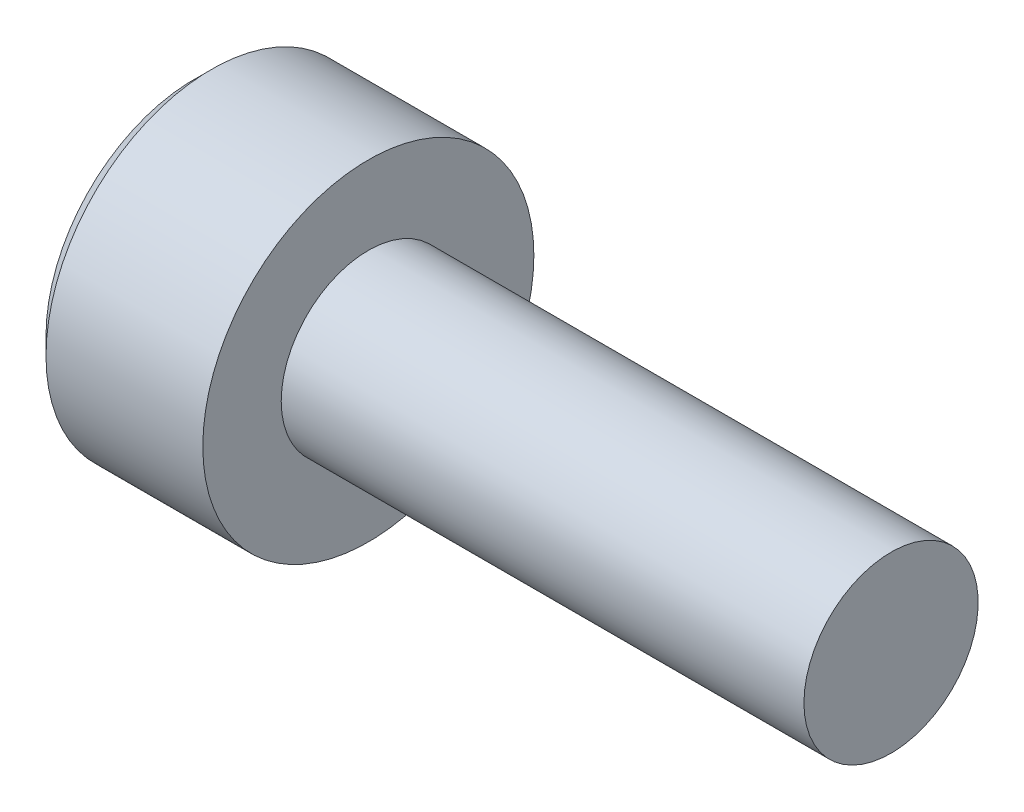
ISO-10303-21;
HEADER;
FILE_DESCRIPTION(('STEP AP214'),'2;1');
FILE_NAME('part.step','',(''),(''),'','','');
FILE_SCHEMA(('AUTOMOTIVE_DESIGN { 1 0 10303 214 1 1 1 1 }'));
ENDSEC;
DATA;
#1=APPLICATION_CONTEXT('core data for automotive mechanical design processes');
#2=APPLICATION_PROTOCOL_DEFINITION('international standard','automotive_design',2000,#1);
#3=PRODUCT_CONTEXT('',#1,'mechanical');
#4=PRODUCT('Part','Part','',(#3));
#5=PRODUCT_RELATED_PRODUCT_CATEGORY('part','',(#4));
#6=PRODUCT_DEFINITION_FORMATION('','',#4);
#7=PRODUCT_DEFINITION_CONTEXT('part definition',#1,'design');
#8=PRODUCT_DEFINITION('design','',#6,#7);
#9=PRODUCT_DEFINITION_SHAPE('','',#8);
#10=(LENGTH_UNIT() NAMED_UNIT(*) SI_UNIT(.MILLI.,.METRE.));
#11=(NAMED_UNIT(*) PLANE_ANGLE_UNIT() SI_UNIT($,.RADIAN.));
#12=(NAMED_UNIT(*) SI_UNIT($,.STERADIAN.) SOLID_ANGLE_UNIT());
#13=UNCERTAINTY_MEASURE_WITH_UNIT(LENGTH_MEASURE(1.E-05),#10,'distance_accuracy_value','');
#14=(GEOMETRIC_REPRESENTATION_CONTEXT(3) GLOBAL_UNCERTAINTY_ASSIGNED_CONTEXT((#13)) GLOBAL_UNIT_ASSIGNED_CONTEXT((#10,
#11,#12)) REPRESENTATION_CONTEXT('',''));
#15=CARTESIAN_POINT('',(0.,0.,0.));
#16=DIRECTION('',(0.,0.,1.));
#17=DIRECTION('',(1.,0.,0.));
#18=AXIS2_PLACEMENT_3D('',#15,#16,#17);
#19=CARTESIAN_POINT('',(-0.999999999976353,0.,0.));
#20=DIRECTION('',(-1.,0.,0.));
#21=DIRECTION('',(0.,0.,1.));
#22=AXIS2_PLACEMENT_3D('',#19,#20,#21);
#23=CONICAL_SURFACE('',#22,0.749999999868578,1.30899693854199);
#24=CARTESIAN_POINT('',(-0.79903810542703,0.,-5.40012479177676E-10));
#25=VERTEX_POINT('',#24);
#26=VERTEX_LOOP('',#25);
#27=FACE_BOUND('',#26,.T.);
#28=CARTESIAN_POINT('',(-1.00000000000682,0.,0.));
#29=DIRECTION('',(-1.,0.,0.));
#30=DIRECTION('',(0.,0.,1.));
#31=AXIS2_PLACEMENT_3D('',#28,#29,#30);
#32=CIRCLE('',#31,0.749999999982265);
#33=CARTESIAN_POINT('',(-1.00000000000892,0.64951905283065,-0.374999999995567));
#34=VERTEX_POINT('',#33);
#35=CARTESIAN_POINT('',(-1.00000000000952,0.,-0.749999999991132));
#36=VERTEX_POINT('',#35);
#37=EDGE_CURVE('E138',#34,#36,#32,.T.);
#38=ORIENTED_EDGE('',*,*,#37,.T.);
#39=CARTESIAN_POINT('',(-1.00000000000682,0.,0.));
#40=DIRECTION('',(-1.,0.,0.));
#41=DIRECTION('',(0.,0.,1.));
#42=AXIS2_PLACEMENT_3D('',#39,#40,#41);
#43=CIRCLE('',#42,0.749999999982265);
#44=CARTESIAN_POINT('',(-1.00000000000892,-0.649519052830649,-0.374999999995567));
#45=VERTEX_POINT('',#44);
#46=EDGE_CURVE('E136',#36,#45,#43,.T.);
#47=ORIENTED_EDGE('',*,*,#46,.T.);
#48=CARTESIAN_POINT('',(-1.00000000000682,0.,0.));
#49=DIRECTION('',(-1.,0.,0.));
#50=DIRECTION('',(0.,0.,1.));
#51=AXIS2_PLACEMENT_3D('',#48,#49,#50);
#52=CIRCLE('',#51,0.749999999982265);
#53=CARTESIAN_POINT('',(-1.00000000000892,-0.64951905283065,0.374999999995567));
#54=VERTEX_POINT('',#53);
#55=EDGE_CURVE('E88',#45,#54,#52,.T.);
#56=ORIENTED_EDGE('',*,*,#55,.T.);
#57=CARTESIAN_POINT('',(-1.00000000000682,0.,0.));
#58=DIRECTION('',(-1.,0.,0.));
#59=DIRECTION('',(0.,0.,1.));
#60=AXIS2_PLACEMENT_3D('',#57,#58,#59);
#61=CIRCLE('',#60,0.749999999982265);
#62=CARTESIAN_POINT('',(-1.00000000000952,0.,0.749999999991132));
#63=VERTEX_POINT('',#62);
#64=EDGE_CURVE('E19',#54,#63,#61,.T.);
#65=ORIENTED_EDGE('',*,*,#64,.T.);
#66=CARTESIAN_POINT('',(-1.00000000000682,0.,0.));
#67=DIRECTION('',(-1.,0.,0.));
#68=DIRECTION('',(0.,0.,1.));
#69=AXIS2_PLACEMENT_3D('',#66,#67,#68);
#70=CIRCLE('',#69,0.749999999982265);
#71=CARTESIAN_POINT('',(-1.00000000000892,0.64951905283065,0.374999999995567));
#72=VERTEX_POINT('',#71);
#73=EDGE_CURVE('E93',#63,#72,#70,.T.);
#74=ORIENTED_EDGE('',*,*,#73,.T.);
#75=CARTESIAN_POINT('',(-1.00000000000682,0.,0.));
#76=DIRECTION('',(-1.,0.,0.));
#77=DIRECTION('',(0.,0.,1.));
#78=AXIS2_PLACEMENT_3D('',#75,#76,#77);
#79=CIRCLE('',#78,0.749999999982265);
#80=EDGE_CURVE('E114',#72,#34,#79,.T.);
#81=ORIENTED_EDGE('',*,*,#80,.T.);
#82=EDGE_LOOP('',(#38,#47,#56,#65,#74,#81));
#83=FACE_BOUND('',#82,.T.);
#84=ADVANCED_FACE('F16',(#27,#83),#23,.F.);
#85=CARTESIAN_POINT('',(-1.,0.,0.));
#86=DIRECTION('',(1.,0.,0.));
#87=DIRECTION('',(0.,0.,-1.));
#88=AXIS2_PLACEMENT_3D('',#85,#86,#87);
#89=PLANE('',#88);
#90=DIRECTION('',(0.,1.,0.));
#91=VECTOR('',#90,1.);
#92=CARTESIAN_POINT('',(-1.00000000001222,0.43301270189222,0.75));
#93=LINE('',#92,#91);
#94=CARTESIAN_POINT('',(-1.00000000000611,-0.433012701895382,0.749999999994524));
#95=VERTEX_POINT('',#94);
#96=EDGE_CURVE('E98',#63,#95,#93,.F.);
#97=ORIENTED_EDGE('',*,*,#96,.F.);
#98=ORIENTED_EDGE('',*,*,#64,.F.);
#99=DIRECTION('',(0.,0.500000000000001,0.866025403784438));
#100=VECTOR('',#99,1.);
#101=CARTESIAN_POINT('',(-1.,-0.43301270189222,0.75));
#102=LINE('',#101,#100);
#103=EDGE_CURVE('E100',#95,#54,#102,.F.);
#104=ORIENTED_EDGE('',*,*,#103,.F.);
#105=EDGE_LOOP('',(#97,#98,#104));
#106=FACE_BOUND('',#105,.T.);
#107=ADVANCED_FACE('F99',(#106),#89,.F.);
#108=CARTESIAN_POINT('',(-1.,0.,0.));
#109=DIRECTION('',(1.,0.,0.));
#110=DIRECTION('',(0.,0.,-1.));
#111=AXIS2_PLACEMENT_3D('',#108,#109,#110);
#112=PLANE('',#111);
#113=DIRECTION('',(0.,0.500000000000001,-0.866025403784438));
#114=VECTOR('',#113,1.);
#115=CARTESIAN_POINT('',(-1.00000000001102,0.86602540378444,0.));
#116=LINE('',#115,#114);
#117=CARTESIAN_POINT('',(-1.00000000000551,0.43301270189222,0.75));
#118=VERTEX_POINT('',#117);
#119=EDGE_CURVE('E112',#72,#118,#116,.F.);
#120=ORIENTED_EDGE('',*,*,#119,.F.);
#121=ORIENTED_EDGE('',*,*,#73,.F.);
#122=DIRECTION('',(0.,1.,0.));
#123=VECTOR('',#122,1.);
#124=CARTESIAN_POINT('',(-1.,0.43301270189222,0.75));
#125=LINE('',#124,#123);
#126=EDGE_CURVE('E109',#118,#63,#125,.F.);
#127=ORIENTED_EDGE('',*,*,#126,.F.);
#128=EDGE_LOOP('',(#120,#121,#127));
#129=FACE_BOUND('',#128,.T.);
#130=ADVANCED_FACE('F108',(#129),#112,.F.);
#131=CARTESIAN_POINT('',(-1.,0.,0.));
#132=DIRECTION('',(1.,0.,0.));
#133=DIRECTION('',(0.,0.,-1.));
#134=AXIS2_PLACEMENT_3D('',#131,#132,#133);
#135=PLANE('',#134);
#136=DIRECTION('',(0.,0.500000000000001,-0.866025403784438));
#137=VECTOR('',#136,1.);
#138=CARTESIAN_POINT('',(-1.,0.86602540378444,0.));
#139=LINE('',#138,#137);
#140=CARTESIAN_POINT('',(-1.00000000000551,0.86602540378444,0.));
#141=VERTEX_POINT('',#140);
#142=EDGE_CURVE('E148',#141,#72,#139,.F.);
#143=ORIENTED_EDGE('',*,*,#142,.F.);
#144=DIRECTION('',(0.,-0.500000000000001,-0.866025403784438));
#145=VECTOR('',#144,1.);
#146=CARTESIAN_POINT('',(-1.00000000001102,0.43301270189222,-0.75));
#147=LINE('',#146,#145);
#148=EDGE_CURVE('E146',#34,#141,#147,.F.);
#149=ORIENTED_EDGE('',*,*,#148,.F.);
#150=ORIENTED_EDGE('',*,*,#80,.F.);
#151=EDGE_LOOP('',(#143,#149,#150));
#152=FACE_BOUND('',#151,.T.);
#153=ADVANCED_FACE('F147',(#152),#135,.F.);
#154=CARTESIAN_POINT('',(-1.,0.,0.));
#155=DIRECTION('',(1.,0.,0.));
#156=DIRECTION('',(0.,0.,-1.));
#157=AXIS2_PLACEMENT_3D('',#154,#155,#156);
#158=PLANE('',#157);
#159=DIRECTION('',(0.,1.,0.));
#160=VECTOR('',#159,1.);
#161=CARTESIAN_POINT('',(-1.00000000001222,-0.43301270189222,-0.75));
#162=LINE('',#161,#160);
#163=CARTESIAN_POINT('',(-1.00000000000611,0.433012701895382,-0.749999999994524));
#164=VERTEX_POINT('',#163);
#165=EDGE_CURVE('E160',#36,#164,#162,.T.);
#166=ORIENTED_EDGE('',*,*,#165,.F.);
#167=ORIENTED_EDGE('',*,*,#37,.F.);
#168=DIRECTION('',(0.,-0.500000000000001,-0.866025403784438));
#169=VECTOR('',#168,1.);
#170=CARTESIAN_POINT('',(-1.,0.43301270189222,-0.75));
#171=LINE('',#170,#169);
#172=EDGE_CURVE('E157',#164,#34,#171,.F.);
#173=ORIENTED_EDGE('',*,*,#172,.F.);
#174=EDGE_LOOP('',(#166,#167,#173));
#175=FACE_BOUND('',#174,.T.);
#176=ADVANCED_FACE('F156',(#175),#158,.F.);
#177=CARTESIAN_POINT('',(-1.,0.,0.));
#178=DIRECTION('',(1.,0.,0.));
#179=DIRECTION('',(0.,0.,-1.));
#180=AXIS2_PLACEMENT_3D('',#177,#178,#179);
#181=PLANE('',#180);
#182=DIRECTION('',(0.,-0.500000000000001,0.866025403784438));
#183=VECTOR('',#182,1.);
#184=CARTESIAN_POINT('',(-1.00000000001102,-0.86602540378444,0.));
#185=LINE('',#184,#183);
#186=CARTESIAN_POINT('',(-1.00000000000551,-0.43301270189222,-0.75));
#187=VERTEX_POINT('',#186);
#188=EDGE_CURVE('E186',#45,#187,#185,.F.);
#189=ORIENTED_EDGE('',*,*,#188,.F.);
#190=ORIENTED_EDGE('',*,*,#46,.F.);
#191=DIRECTION('',(0.,1.,0.));
#192=VECTOR('',#191,1.);
#193=CARTESIAN_POINT('',(-1.,-0.43301270189222,-0.75));
#194=LINE('',#193,#192);
#195=EDGE_CURVE('E190',#187,#36,#194,.T.);
#196=ORIENTED_EDGE('',*,*,#195,.F.);
#197=EDGE_LOOP('',(#189,#190,#196));
#198=FACE_BOUND('',#197,.T.);
#199=ADVANCED_FACE('F311',(#198),#181,.F.);
#200=CARTESIAN_POINT('',(-1.,0.,0.));
#201=DIRECTION('',(1.,0.,0.));
#202=DIRECTION('',(0.,0.,-1.));
#203=AXIS2_PLACEMENT_3D('',#200,#201,#202);
#204=PLANE('',#203);
#205=DIRECTION('',(0.,0.500000000000001,0.866025403784438));
#206=VECTOR('',#205,1.);
#207=CARTESIAN_POINT('',(-1.00000000001102,-0.43301270189222,0.75));
#208=LINE('',#207,#206);
#209=CARTESIAN_POINT('',(-1.00000000000367,-0.86602540378444,0.));
#210=VERTEX_POINT('',#209);
#211=EDGE_CURVE('E123',#54,#210,#208,.F.);
#212=ORIENTED_EDGE('',*,*,#211,.F.);
#213=ORIENTED_EDGE('',*,*,#55,.F.);
#214=DIRECTION('',(0.,-0.500000000000001,0.866025403784438));
#215=VECTOR('',#214,1.);
#216=CARTESIAN_POINT('',(-1.,-0.86602540378444,0.));
#217=LINE('',#216,#215);
#218=EDGE_CURVE('E191',#210,#45,#217,.F.);
#219=ORIENTED_EDGE('',*,*,#218,.F.);
#220=EDGE_LOOP('',(#212,#213,#219));
#221=FACE_BOUND('',#220,.T.);
#222=ADVANCED_FACE('F319',(#221),#204,.F.);
#223=CARTESIAN_POINT('',(-1.,-0.43301270189222,0.75));
#224=DIRECTION('',(0.,0.866025403784438,-0.500000000000001));
#225=DIRECTION('',(0.,0.500000000000001,0.866025403784438));
#226=AXIS2_PLACEMENT_3D('',#223,#224,#225);
#227=PLANE('',#226);
#228=DIRECTION('',(-1.,0.,0.));
#229=VECTOR('',#228,1.);
#230=CARTESIAN_POINT('',(-1.,-0.43301270189222,0.75));
#231=LINE('',#230,#229);
#232=CARTESIAN_POINT('',(-2.,-0.43301270189222,0.75));
#233=VERTEX_POINT('',#232);
#234=EDGE_CURVE('E105',#95,#233,#231,.T.);
#235=ORIENTED_EDGE('',*,*,#234,.F.);
#236=ORIENTED_EDGE('',*,*,#103,.T.);
#237=ORIENTED_EDGE('',*,*,#211,.T.);
#238=DIRECTION('',(1.,0.,0.));
#239=VECTOR('',#238,1.);
#240=CARTESIAN_POINT('',(-1.,-0.86602540378444,0.));
#241=LINE('',#240,#239);
#242=CARTESIAN_POINT('',(-2.,-0.86602540378444,0.));
#243=VERTEX_POINT('',#242);
#244=EDGE_CURVE('E194',#243,#210,#241,.T.);
#245=ORIENTED_EDGE('',*,*,#244,.F.);
#246=DIRECTION('',(0.,0.500000000000001,0.866025403784438));
#247=VECTOR('',#246,1.);
#248=CARTESIAN_POINT('',(-2.,-0.86602540378444,0.));
#249=LINE('',#248,#247);
#250=EDGE_CURVE('E182',#243,#233,#249,.T.);
#251=ORIENTED_EDGE('',*,*,#250,.T.);
#252=EDGE_LOOP('',(#235,#236,#237,#245,#251));
#253=FACE_BOUND('',#252,.T.);
#254=ADVANCED_FACE('F328',(#253),#227,.T.);
#255=CARTESIAN_POINT('',(-1.,0.43301270189222,0.75));
#256=DIRECTION('',(0.,0.,-1.));
#257=DIRECTION('',(-1.,0.,0.));
#258=AXIS2_PLACEMENT_3D('',#255,#256,#257);
#259=PLANE('',#258);
#260=DIRECTION('',(1.,0.,0.));
#261=VECTOR('',#260,1.);
#262=CARTESIAN_POINT('',(-1.,0.43301270189222,0.75));
#263=LINE('',#262,#261);
#264=CARTESIAN_POINT('',(-2.,0.43301270189222,0.75));
#265=VERTEX_POINT('',#264);
#266=EDGE_CURVE('E117',#118,#265,#263,.F.);
#267=ORIENTED_EDGE('',*,*,#266,.F.);
#268=ORIENTED_EDGE('',*,*,#126,.T.);
#269=ORIENTED_EDGE('',*,*,#96,.T.);
#270=ORIENTED_EDGE('',*,*,#234,.T.);
#271=DIRECTION('',(0.,1.,0.));
#272=VECTOR('',#271,1.);
#273=CARTESIAN_POINT('',(-2.,0.,0.75));
#274=LINE('',#273,#272);
#275=EDGE_CURVE('E178',#233,#265,#274,.T.);
#276=ORIENTED_EDGE('',*,*,#275,.T.);
#277=EDGE_LOOP('',(#267,#268,#269,#270,#276));
#278=FACE_BOUND('',#277,.T.);
#279=ADVANCED_FACE('F115',(#278),#259,.T.);
#280=CARTESIAN_POINT('',(-1.,0.86602540378444,0.));
#281=DIRECTION('',(0.,-0.866025403784438,-0.500000000000001));
#282=DIRECTION('',(0.,0.500000000000001,-0.866025403784438));
#283=AXIS2_PLACEMENT_3D('',#280,#281,#282);
#284=PLANE('',#283);
#285=DIRECTION('',(1.,0.,0.));
#286=VECTOR('',#285,1.);
#287=CARTESIAN_POINT('',(-1.,0.86602540378444,0.));
#288=LINE('',#287,#286);
#289=CARTESIAN_POINT('',(-2.,0.86602540378444,0.));
#290=VERTEX_POINT('',#289);
#291=EDGE_CURVE('E153',#141,#290,#288,.F.);
#292=ORIENTED_EDGE('',*,*,#291,.F.);
#293=ORIENTED_EDGE('',*,*,#142,.T.);
#294=ORIENTED_EDGE('',*,*,#119,.T.);
#295=ORIENTED_EDGE('',*,*,#266,.T.);
#296=DIRECTION('',(0.,0.500000000000001,-0.866025403784438));
#297=VECTOR('',#296,1.);
#298=CARTESIAN_POINT('',(-2.,0.43301270189222,0.75));
#299=LINE('',#298,#297);
#300=EDGE_CURVE('E172',#265,#290,#299,.T.);
#301=ORIENTED_EDGE('',*,*,#300,.T.);
#302=EDGE_LOOP('',(#292,#293,#294,#295,#301));
#303=FACE_BOUND('',#302,.T.);
#304=ADVANCED_FACE('F171',(#303),#284,.T.);
#305=CARTESIAN_POINT('',(-1.,0.43301270189222,-0.75));
#306=DIRECTION('',(0.,-0.866025403784438,0.500000000000001));
#307=DIRECTION('',(0.,-0.500000000000001,-0.866025403784438));
#308=AXIS2_PLACEMENT_3D('',#305,#306,#307);
#309=PLANE('',#308);
#310=DIRECTION('',(1.,0.,0.));
#311=VECTOR('',#310,1.);
#312=CARTESIAN_POINT('',(-1.,0.43301270189222,-0.75));
#313=LINE('',#312,#311);
#314=CARTESIAN_POINT('',(-2.,0.43301270189222,-0.75));
#315=VERTEX_POINT('',#314);
#316=EDGE_CURVE('E163',#164,#315,#313,.F.);
#317=ORIENTED_EDGE('',*,*,#316,.F.);
#318=ORIENTED_EDGE('',*,*,#172,.T.);
#319=ORIENTED_EDGE('',*,*,#148,.T.);
#320=ORIENTED_EDGE('',*,*,#291,.T.);
#321=DIRECTION('',(0.,-0.500000000000001,-0.866025403784438));
#322=VECTOR('',#321,1.);
#323=CARTESIAN_POINT('',(-2.,0.86602540378444,0.));
#324=LINE('',#323,#322);
#325=EDGE_CURVE('E179',#290,#315,#324,.T.);
#326=ORIENTED_EDGE('',*,*,#325,.T.);
#327=EDGE_LOOP('',(#317,#318,#319,#320,#326));
#328=FACE_BOUND('',#327,.T.);
#329=ADVANCED_FACE('F162',(#328),#309,.T.);
#330=CARTESIAN_POINT('',(-1.,-0.43301270189222,-0.75));
#331=DIRECTION('',(0.,0.,1.));
#332=DIRECTION('',(1.,0.,0.));
#333=AXIS2_PLACEMENT_3D('',#330,#331,#332);
#334=PLANE('',#333);
#335=DIRECTION('',(1.,0.,0.));
#336=VECTOR('',#335,1.);
#337=CARTESIAN_POINT('',(-1.,-0.43301270189222,-0.75));
#338=LINE('',#337,#336);
#339=CARTESIAN_POINT('',(-2.,-0.43301270189222,-0.75));
#340=VERTEX_POINT('',#339);
#341=EDGE_CURVE('E189',#187,#340,#338,.F.);
#342=ORIENTED_EDGE('',*,*,#341,.F.);
#343=ORIENTED_EDGE('',*,*,#195,.T.);
#344=ORIENTED_EDGE('',*,*,#165,.T.);
#345=ORIENTED_EDGE('',*,*,#316,.T.);
#346=DIRECTION('',(0.,1.,0.));
#347=VECTOR('',#346,1.);
#348=CARTESIAN_POINT('',(-2.,0.,-0.75));
#349=LINE('',#348,#347);
#350=EDGE_CURVE('E34',#315,#340,#349,.F.);
#351=ORIENTED_EDGE('',*,*,#350,.T.);
#352=EDGE_LOOP('',(#342,#343,#344,#345,#351));
#353=FACE_BOUND('',#352,.T.);
#354=ADVANCED_FACE('F203',(#353),#334,.T.);
#355=CARTESIAN_POINT('',(-1.,-0.86602540378444,0.));
#356=DIRECTION('',(0.,0.866025403784438,0.500000000000001));
#357=DIRECTION('',(0.,-0.500000000000001,0.866025403784438));
#358=AXIS2_PLACEMENT_3D('',#355,#356,#357);
#359=PLANE('',#358);
#360=ORIENTED_EDGE('',*,*,#244,.T.);
#361=ORIENTED_EDGE('',*,*,#218,.T.);
#362=ORIENTED_EDGE('',*,*,#188,.T.);
#363=ORIENTED_EDGE('',*,*,#341,.T.);
#364=DIRECTION('',(0.,-0.500000000000001,0.866025403784438));
#365=VECTOR('',#364,1.);
#366=CARTESIAN_POINT('',(-2.,-0.43301270189222,-0.75));
#367=LINE('',#366,#365);
#368=EDGE_CURVE('E134',#340,#243,#367,.T.);
#369=ORIENTED_EDGE('',*,*,#368,.T.);
#370=EDGE_LOOP('',(#360,#361,#362,#363,#369));
#371=FACE_BOUND('',#370,.T.);
#372=ADVANCED_FACE('F224',(#371),#359,.T.);
#373=CARTESIAN_POINT('',(-2.,0.,0.));
#374=DIRECTION('',(1.,0.,0.));
#375=DIRECTION('',(0.,0.,-1.));
#376=AXIS2_PLACEMENT_3D('',#373,#374,#375);
#377=PLANE('',#376);
#378=CARTESIAN_POINT('',(-1.99999999995271,0.,0.));
#379=DIRECTION('',(1.,0.,0.));
#380=DIRECTION('',(0.,0.,-1.));
#381=AXIS2_PLACEMENT_3D('',#378,#379,#380);
#382=CIRCLE('',#381,1.70000000008486);
#383=CARTESIAN_POINT('',(-1.99999999995271,0.,-1.70000000008486));
#384=VERTEX_POINT('',#383);
#385=EDGE_CURVE('E131',#384,#384,#382,.T.);
#386=ORIENTED_EDGE('',*,*,#385,.F.);
#387=EDGE_LOOP('',(#386));
#388=FACE_BOUND('',#387,.T.);
#389=ORIENTED_EDGE('',*,*,#350,.F.);
#390=ORIENTED_EDGE('',*,*,#325,.F.);
#391=ORIENTED_EDGE('',*,*,#300,.F.);
#392=ORIENTED_EDGE('',*,*,#275,.F.);
#393=ORIENTED_EDGE('',*,*,#250,.F.);
#394=ORIENTED_EDGE('',*,*,#368,.F.);
#395=EDGE_LOOP('',(#389,#390,#391,#392,#393,#394));
#396=FACE_BOUND('',#395,.T.);
#397=ADVANCED_FACE('F176',(#388,#396),#377,.F.);
#398=CARTESIAN_POINT('',(-1.79999999988922,0.,0.));
#399=DIRECTION('',(1.,0.,0.));
#400=DIRECTION('',(0.,0.,-1.));
#401=AXIS2_PLACEMENT_3D('',#398,#399,#400);
#402=CONICAL_SURFACE('',#401,1.9000000000915,0.78539816325534);
#403=ORIENTED_EDGE('',*,*,#385,.T.);
#404=EDGE_LOOP('',(#403));
#405=FACE_BOUND('',#404,.T.);
#406=CARTESIAN_POINT('',(-1.8,0.,0.));
#407=DIRECTION('',(1.,0.,0.));
#408=DIRECTION('',(0.,0.,-1.));
#409=AXIS2_PLACEMENT_3D('',#406,#407,#408);
#410=CIRCLE('',#409,1.9);
#411=CARTESIAN_POINT('',(-1.8,0.,-1.9));
#412=VERTEX_POINT('',#411);
#413=EDGE_CURVE('E130',#412,#412,#410,.T.);
#414=ORIENTED_EDGE('',*,*,#413,.F.);
#415=EDGE_LOOP('',(#414));
#416=FACE_BOUND('',#415,.T.);
#417=ADVANCED_FACE('F212',(#405,#416),#402,.T.);
#418=CARTESIAN_POINT('',(6.,0.,0.));
#419=DIRECTION('',(1.,0.,0.));
#420=DIRECTION('',(0.,0.,-1.));
#421=AXIS2_PLACEMENT_3D('',#418,#419,#420);
#422=CYLINDRICAL_SURFACE('',#421,1.9);
#423=ORIENTED_EDGE('',*,*,#413,.T.);
#424=EDGE_LOOP('',(#423));
#425=FACE_BOUND('',#424,.T.);
#426=CARTESIAN_POINT('',(0.,0.,0.));
#427=DIRECTION('',(1.,0.,0.));
#428=DIRECTION('',(0.,0.,-1.));
#429=AXIS2_PLACEMENT_3D('',#426,#427,#428);
#430=CIRCLE('',#429,1.9);
#431=CARTESIAN_POINT('',(0.,0.,-1.9));
#432=VERTEX_POINT('',#431);
#433=EDGE_CURVE('E127',#432,#432,#430,.F.);
#434=ORIENTED_EDGE('',*,*,#433,.T.);
#435=EDGE_LOOP('',(#434));
#436=FACE_BOUND('',#435,.T.);
#437=ADVANCED_FACE('F209',(#425,#436),#422,.T.);
#438=CARTESIAN_POINT('',(6.,0.,0.));
#439=DIRECTION('',(1.,0.,0.));
#440=DIRECTION('',(0.,0.,-1.));
#441=AXIS2_PLACEMENT_3D('',#438,#439,#440);
#442=PLANE('',#441);
#443=CARTESIAN_POINT('',(6.,0.,0.));
#444=DIRECTION('',(-1.,0.,0.));
#445=DIRECTION('',(0.,0.,1.));
#446=AXIS2_PLACEMENT_3D('',#443,#444,#445);
#447=CIRCLE('',#446,1.);
#448=CARTESIAN_POINT('',(6.,0.,1.));
#449=VERTEX_POINT('',#448);
#450=EDGE_CURVE('E25',#449,#449,#447,.T.);
#451=ORIENTED_EDGE('',*,*,#450,.F.);
#452=EDGE_LOOP('',(#451));
#453=FACE_BOUND('',#452,.T.);
#454=ADVANCED_FACE('F222',(#453),#442,.T.);
#455=CARTESIAN_POINT('',(0.,1.9,0.));
#456=DIRECTION('',(-1.,0.,0.));
#457=DIRECTION('',(0.,0.,1.));
#458=AXIS2_PLACEMENT_3D('',#455,#456,#457);
#459=PLANE('',#458);
#460=ORIENTED_EDGE('',*,*,#433,.F.);
#461=EDGE_LOOP('',(#460));
#462=FACE_BOUND('',#461,.T.);
#463=CARTESIAN_POINT('',(0.,0.,0.));
#464=DIRECTION('',(-1.,0.,0.));
#465=DIRECTION('',(0.,0.,1.));
#466=AXIS2_PLACEMENT_3D('',#463,#464,#465);
#467=CIRCLE('',#466,1.);
#468=CARTESIAN_POINT('',(0.,0.,1.));
#469=VERTEX_POINT('',#468);
#470=EDGE_CURVE('E11',#469,#469,#467,.F.);
#471=ORIENTED_EDGE('',*,*,#470,.F.);
#472=EDGE_LOOP('',(#471));
#473=FACE_BOUND('',#472,.T.);
#474=ADVANCED_FACE('F229',(#462,#473),#459,.F.);
#475=CARTESIAN_POINT('',(6.,0.,0.));
#476=DIRECTION('',(-1.,0.,0.));
#477=DIRECTION('',(0.,0.,1.));
#478=AXIS2_PLACEMENT_3D('',#475,#476,#477);
#479=CYLINDRICAL_SURFACE('',#478,1.);
#480=ORIENTED_EDGE('',*,*,#470,.T.);
#481=EDGE_LOOP('',(#480));
#482=FACE_BOUND('',#481,.T.);
#483=ORIENTED_EDGE('',*,*,#450,.T.);
#484=EDGE_LOOP('',(#483));
#485=FACE_BOUND('',#484,.T.);
#486=ADVANCED_FACE('F227',(#482,#485),#479,.T.);
#487=CLOSED_SHELL('',(#84,#107,#130,#153,#176,#199,#222,#254,#279,#304,#329,#354,#372,#397,#417,
#437,#454,#474,#486));
#488=MANIFOLD_SOLID_BREP('B1',#487);
#489=ADVANCED_BREP_SHAPE_REPRESENTATION('',(#18,#488),#14);
#490=SHAPE_DEFINITION_REPRESENTATION(#9,#489);
ENDSEC;
END-ISO-10303-21;
